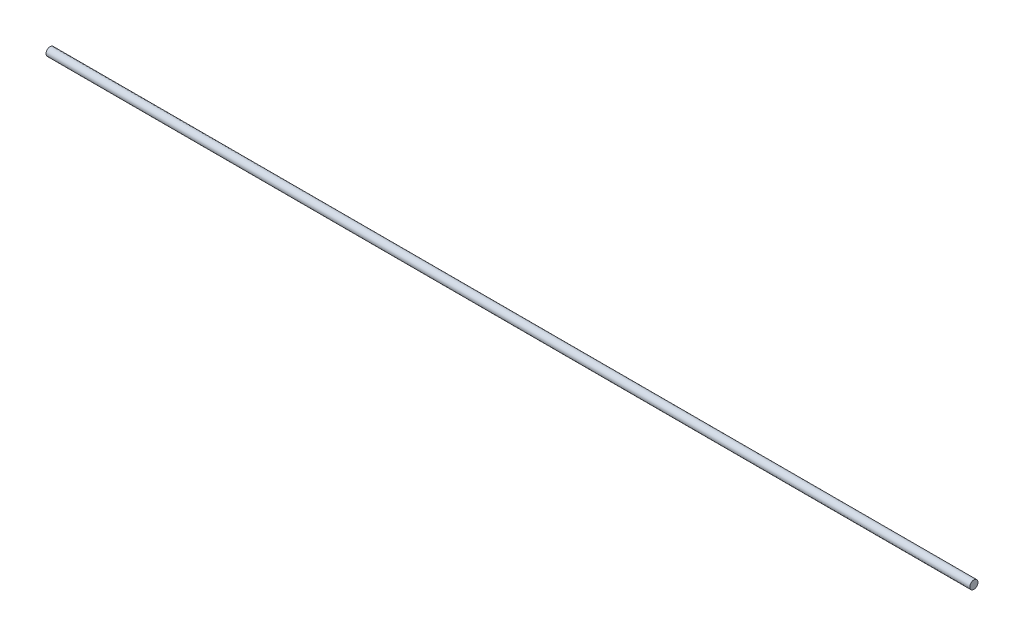
ISO-10303-21;
HEADER;
FILE_DESCRIPTION(('STEP AP214'),'2;1');
FILE_NAME('part.step','',(''),(''),'','','');
FILE_SCHEMA(('AUTOMOTIVE_DESIGN { 1 0 10303 214 1 1 1 1 }'));
ENDSEC;
DATA;
#1=APPLICATION_CONTEXT('core data for automotive mechanical design processes');
#2=APPLICATION_PROTOCOL_DEFINITION('international standard','automotive_design',2000,#1);
#3=PRODUCT_CONTEXT('',#1,'mechanical');
#4=PRODUCT('Part','Part','',(#3));
#5=PRODUCT_RELATED_PRODUCT_CATEGORY('part','',(#4));
#6=PRODUCT_DEFINITION_FORMATION('','',#4);
#7=PRODUCT_DEFINITION_CONTEXT('part definition',#1,'design');
#8=PRODUCT_DEFINITION('design','',#6,#7);
#9=PRODUCT_DEFINITION_SHAPE('','',#8);
#10=(LENGTH_UNIT() NAMED_UNIT(*) SI_UNIT(.MILLI.,.METRE.));
#11=(NAMED_UNIT(*) PLANE_ANGLE_UNIT() SI_UNIT($,.RADIAN.));
#12=(NAMED_UNIT(*) SI_UNIT($,.STERADIAN.) SOLID_ANGLE_UNIT());
#13=UNCERTAINTY_MEASURE_WITH_UNIT(LENGTH_MEASURE(1.E-05),#10,'distance_accuracy_value','');
#14=(GEOMETRIC_REPRESENTATION_CONTEXT(3) GLOBAL_UNCERTAINTY_ASSIGNED_CONTEXT((#13)) GLOBAL_UNIT_ASSIGNED_CONTEXT((#10,
#11,#12)) REPRESENTATION_CONTEXT('',''));
#15=CARTESIAN_POINT('',(0.,0.,0.));
#16=DIRECTION('',(0.,0.,1.));
#17=DIRECTION('',(1.,0.,0.));
#18=AXIS2_PLACEMENT_3D('',#15,#16,#17);
#19=CARTESIAN_POINT('',(711.2,0.,0.));
#20=DIRECTION('',(-1.,0.,0.));
#21=DIRECTION('',(0.,0.,1.));
#22=AXIS2_PLACEMENT_3D('',#19,#20,#21);
#23=CYLINDRICAL_SURFACE('',#22,3.175);
#24=CARTESIAN_POINT('',(711.2,0.,0.));
#25=DIRECTION('',(1.,0.,0.));
#26=DIRECTION('',(0.,0.,-1.));
#27=AXIS2_PLACEMENT_3D('',#24,#25,#26);
#28=CIRCLE('',#27,3.175);
#29=CARTESIAN_POINT('',(711.2,0.,-3.175));
#30=VERTEX_POINT('',#29);
#31=EDGE_CURVE('E10',#30,#30,#28,.T.);
#32=ORIENTED_EDGE('',*,*,#31,.F.);
#33=EDGE_LOOP('',(#32));
#34=FACE_BOUND('',#33,.T.);
#35=CARTESIAN_POINT('',(0.,0.,0.));
#36=DIRECTION('',(1.,0.,0.));
#37=DIRECTION('',(0.,0.,-1.));
#38=AXIS2_PLACEMENT_3D('',#35,#36,#37);
#39=CIRCLE('',#38,3.175);
#40=CARTESIAN_POINT('',(0.,0.,-3.175));
#41=VERTEX_POINT('',#40);
#42=EDGE_CURVE('E40',#41,#41,#39,.T.);
#43=ORIENTED_EDGE('',*,*,#42,.T.);
#44=EDGE_LOOP('',(#43));
#45=FACE_BOUND('',#44,.T.);
#46=ADVANCED_FACE('F37',(#34,#45),#23,.T.);
#47=CARTESIAN_POINT('',(711.2,0.,0.));
#48=DIRECTION('',(1.,0.,0.));
#49=DIRECTION('',(0.,0.,-1.));
#50=AXIS2_PLACEMENT_3D('',#47,#48,#49);
#51=PLANE('',#50);
#52=ORIENTED_EDGE('',*,*,#31,.T.);
#53=EDGE_LOOP('',(#52));
#54=FACE_BOUND('',#53,.T.);
#55=ADVANCED_FACE('F54',(#54),#51,.T.);
#56=CARTESIAN_POINT('',(0.,0.,0.));
#57=DIRECTION('',(1.,0.,0.));
#58=DIRECTION('',(0.,0.,-1.));
#59=AXIS2_PLACEMENT_3D('',#56,#57,#58);
#60=PLANE('',#59);
#61=ORIENTED_EDGE('',*,*,#42,.F.);
#62=EDGE_LOOP('',(#61));
#63=FACE_BOUND('',#62,.T.);
#64=ADVANCED_FACE('F52',(#63),#60,.F.);
#65=CLOSED_SHELL('',(#46,#55,#64));
#66=MANIFOLD_SOLID_BREP('B2',#65);
#67=ADVANCED_BREP_SHAPE_REPRESENTATION('',(#18,#66),#14);
#68=SHAPE_DEFINITION_REPRESENTATION(#9,#67);
ENDSEC;
END-ISO-10303-21;
